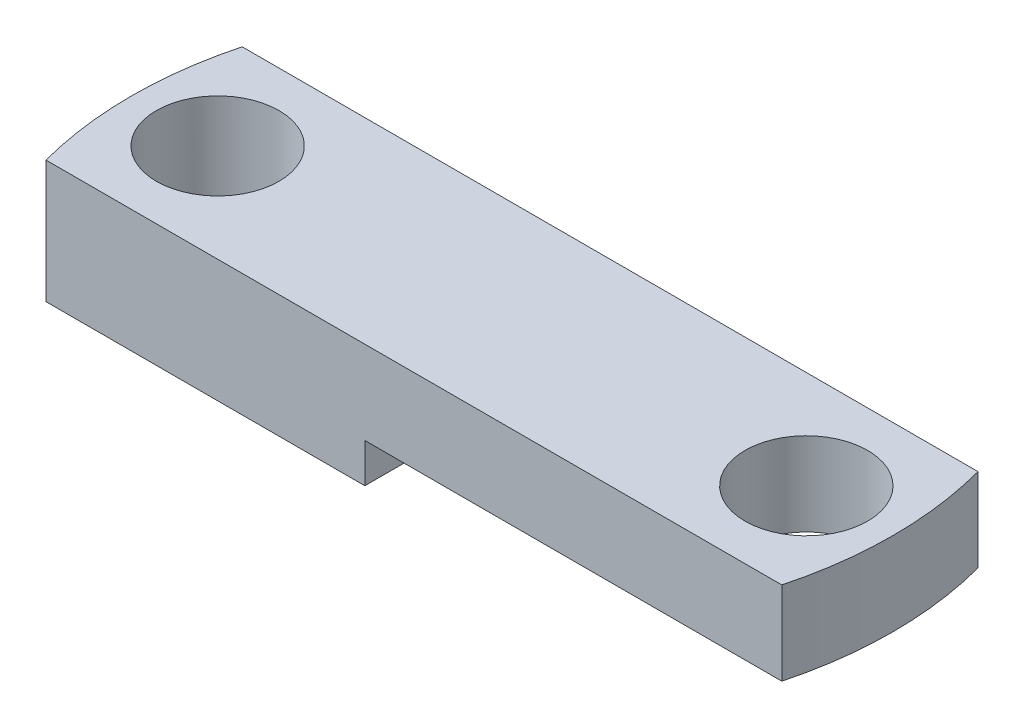
ISO-10303-21;
HEADER;
FILE_DESCRIPTION(('STEP AP214'),'2;1');
FILE_NAME('part.step','',(''),(''),'','','');
FILE_SCHEMA(('AUTOMOTIVE_DESIGN { 1 0 10303 214 1 1 1 1 }'));
ENDSEC;
DATA;
#1=APPLICATION_CONTEXT('core data for automotive mechanical design processes');
#2=APPLICATION_PROTOCOL_DEFINITION('international standard','automotive_design',2000,#1);
#3=PRODUCT_CONTEXT('',#1,'mechanical');
#4=PRODUCT('Part','Part','',(#3));
#5=PRODUCT_RELATED_PRODUCT_CATEGORY('part','',(#4));
#6=PRODUCT_DEFINITION_FORMATION('','',#4);
#7=PRODUCT_DEFINITION_CONTEXT('part definition',#1,'design');
#8=PRODUCT_DEFINITION('design','',#6,#7);
#9=PRODUCT_DEFINITION_SHAPE('','',#8);
#10=(LENGTH_UNIT() NAMED_UNIT(*) SI_UNIT(.MILLI.,.METRE.));
#11=(NAMED_UNIT(*) PLANE_ANGLE_UNIT() SI_UNIT($,.RADIAN.));
#12=(NAMED_UNIT(*) SI_UNIT($,.STERADIAN.) SOLID_ANGLE_UNIT());
#13=UNCERTAINTY_MEASURE_WITH_UNIT(LENGTH_MEASURE(1.E-05),#10,'distance_accuracy_value','');
#14=(GEOMETRIC_REPRESENTATION_CONTEXT(3) GLOBAL_UNCERTAINTY_ASSIGNED_CONTEXT((#13)) GLOBAL_UNIT_ASSIGNED_CONTEXT((#10,
#11,#12)) REPRESENTATION_CONTEXT('',''));
#15=CARTESIAN_POINT('',(0.,0.,0.));
#16=DIRECTION('',(0.,0.,1.));
#17=DIRECTION('',(1.,0.,0.));
#18=AXIS2_PLACEMENT_3D('',#15,#16,#17);
#19=CARTESIAN_POINT('',(0.,6.35,0.));
#20=DIRECTION('',(0.,-1.,0.));
#21=DIRECTION('',(0.,0.,-1.));
#22=AXIS2_PLACEMENT_3D('',#19,#20,#21);
#23=CYLINDRICAL_SURFACE('',#22,19.7157018642502);
#24=DIRECTION('',(0.,-1.,0.));
#25=VECTOR('',#24,1.);
#26=CARTESIAN_POINT('',(19.05,6.35,5.08));
#27=LINE('',#26,#25);
#28=CARTESIAN_POINT('',(19.05,6.35,5.08));
#29=VERTEX_POINT('',#28);
#30=CARTESIAN_POINT('',(19.05,2.032,5.08));
#31=VERTEX_POINT('',#30);
#32=EDGE_CURVE('E123',#29,#31,#27,.T.);
#33=ORIENTED_EDGE('',*,*,#32,.T.);
#34=CARTESIAN_POINT('',(0.,2.032,0.));
#35=DIRECTION('',(0.,-1.,0.));
#36=DIRECTION('',(0.,0.,1.));
#37=AXIS2_PLACEMENT_3D('',#34,#35,#36);
#38=CIRCLE('',#37,19.7157018642502);
#39=CARTESIAN_POINT('',(19.05,2.032,-5.08));
#40=VERTEX_POINT('',#39);
#41=EDGE_CURVE('E107',#40,#31,#38,.T.);
#42=ORIENTED_EDGE('',*,*,#41,.F.);
#43=DIRECTION('',(0.,-1.,0.));
#44=VECTOR('',#43,1.);
#45=CARTESIAN_POINT('',(19.05,6.35,-5.08));
#46=LINE('',#45,#44);
#47=CARTESIAN_POINT('',(19.05,6.35,-5.08));
#48=VERTEX_POINT('',#47);
#49=EDGE_CURVE('E11',#48,#40,#46,.T.);
#50=ORIENTED_EDGE('',*,*,#49,.F.);
#51=CARTESIAN_POINT('',(0.,6.35,0.));
#52=DIRECTION('',(0.,1.,0.));
#53=DIRECTION('',(0.,0.,1.));
#54=AXIS2_PLACEMENT_3D('',#51,#52,#53);
#55=CIRCLE('',#54,19.7157018642502);
#56=EDGE_CURVE('E127',#29,#48,#55,.T.);
#57=ORIENTED_EDGE('',*,*,#56,.F.);
#58=EDGE_LOOP('',(#33,#42,#50,#57));
#59=FACE_BOUND('',#58,.T.);
#60=ADVANCED_FACE('F43',(#59),#23,.T.);
#61=CARTESIAN_POINT('',(-19.05,6.35,-5.08));
#62=DIRECTION('',(0.,0.,1.));
#63=DIRECTION('',(1.,0.,0.));
#64=AXIS2_PLACEMENT_3D('',#61,#62,#63);
#65=PLANE('',#64);
#66=DIRECTION('',(1.,0.,0.));
#67=VECTOR('',#66,1.);
#68=CARTESIAN_POINT('',(19.05,2.032,-5.08));
#69=LINE('',#68,#67);
#70=CARTESIAN_POINT('',(-2.53999999999999,2.032,-5.08));
#71=VERTEX_POINT('',#70);
#72=EDGE_CURVE('E114',#71,#40,#69,.T.);
#73=ORIENTED_EDGE('',*,*,#72,.F.);
#74=DIRECTION('',(0.,-1.,0.));
#75=VECTOR('',#74,1.);
#76=CARTESIAN_POINT('',(-2.53999999999999,2.032,-5.08));
#77=LINE('',#76,#75);
#78=CARTESIAN_POINT('',(-2.53999999999999,0.,-5.08));
#79=VERTEX_POINT('',#78);
#80=EDGE_CURVE('E164',#71,#79,#77,.T.);
#81=ORIENTED_EDGE('',*,*,#80,.T.);
#82=DIRECTION('',(-1.,0.,0.));
#83=VECTOR('',#82,1.);
#84=CARTESIAN_POINT('',(-19.05,0.,-5.08));
#85=LINE('',#84,#83);
#86=CARTESIAN_POINT('',(-19.05,0.,-5.08));
#87=VERTEX_POINT('',#86);
#88=EDGE_CURVE('E139',#79,#87,#85,.T.);
#89=ORIENTED_EDGE('',*,*,#88,.T.);
#90=DIRECTION('',(0.,-1.,0.));
#91=VECTOR('',#90,1.);
#92=CARTESIAN_POINT('',(-19.05,6.35,-5.08));
#93=LINE('',#92,#91);
#94=CARTESIAN_POINT('',(-19.05,6.35,-5.08));
#95=VERTEX_POINT('',#94);
#96=EDGE_CURVE('E51',#95,#87,#93,.T.);
#97=ORIENTED_EDGE('',*,*,#96,.F.);
#98=DIRECTION('',(-1.,0.,0.));
#99=VECTOR('',#98,1.);
#100=CARTESIAN_POINT('',(-19.05,6.35,-5.08));
#101=LINE('',#100,#99);
#102=EDGE_CURVE('E91',#48,#95,#101,.T.);
#103=ORIENTED_EDGE('',*,*,#102,.F.);
#104=ORIENTED_EDGE('',*,*,#49,.T.);
#105=EDGE_LOOP('',(#73,#81,#89,#97,#103,#104));
#106=FACE_BOUND('',#105,.T.);
#107=ADVANCED_FACE('F166',(#106),#65,.F.);
#108=CARTESIAN_POINT('',(0.,6.35,0.));
#109=DIRECTION('',(0.,-1.,0.));
#110=DIRECTION('',(0.,0.,-1.));
#111=AXIS2_PLACEMENT_3D('',#108,#109,#110);
#112=CYLINDRICAL_SURFACE('',#111,19.7157018642502);
#113=CARTESIAN_POINT('',(0.,0.,0.));
#114=DIRECTION('',(0.,1.,0.));
#115=DIRECTION('',(0.,0.,1.));
#116=AXIS2_PLACEMENT_3D('',#113,#114,#115);
#117=CIRCLE('',#116,19.7157018642502);
#118=CARTESIAN_POINT('',(-19.05,0.,5.08));
#119=VERTEX_POINT('',#118);
#120=EDGE_CURVE('E84',#87,#119,#117,.T.);
#121=ORIENTED_EDGE('',*,*,#120,.T.);
#122=DIRECTION('',(0.,-1.,0.));
#123=VECTOR('',#122,1.);
#124=CARTESIAN_POINT('',(-19.05,6.35,5.08));
#125=LINE('',#124,#123);
#126=CARTESIAN_POINT('',(-19.05,6.35,5.08));
#127=VERTEX_POINT('',#126);
#128=EDGE_CURVE('E128',#127,#119,#125,.T.);
#129=ORIENTED_EDGE('',*,*,#128,.F.);
#130=CARTESIAN_POINT('',(0.,6.35,0.));
#131=DIRECTION('',(0.,1.,0.));
#132=DIRECTION('',(0.,0.,1.));
#133=AXIS2_PLACEMENT_3D('',#130,#131,#132);
#134=CIRCLE('',#133,19.7157018642502);
#135=EDGE_CURVE('E131',#95,#127,#134,.T.);
#136=ORIENTED_EDGE('',*,*,#135,.F.);
#137=ORIENTED_EDGE('',*,*,#96,.T.);
#138=EDGE_LOOP('',(#121,#129,#136,#137));
#139=FACE_BOUND('',#138,.T.);
#140=ADVANCED_FACE('F168',(#139),#112,.T.);
#141=CARTESIAN_POINT('',(-19.05,6.35,5.08));
#142=DIRECTION('',(0.,0.,-1.));
#143=DIRECTION('',(-1.,0.,0.));
#144=AXIS2_PLACEMENT_3D('',#141,#142,#143);
#145=PLANE('',#144);
#146=DIRECTION('',(1.,0.,0.));
#147=VECTOR('',#146,1.);
#148=CARTESIAN_POINT('',(-19.05,0.,5.08));
#149=LINE('',#148,#147);
#150=CARTESIAN_POINT('',(-2.53999999999999,0.,5.08));
#151=VERTEX_POINT('',#150);
#152=EDGE_CURVE('E134',#119,#151,#149,.T.);
#153=ORIENTED_EDGE('',*,*,#152,.T.);
#154=DIRECTION('',(0.,-1.,0.));
#155=VECTOR('',#154,1.);
#156=CARTESIAN_POINT('',(-2.53999999999999,2.032,5.08));
#157=LINE('',#156,#155);
#158=CARTESIAN_POINT('',(-2.53999999999999,2.032,5.08));
#159=VERTEX_POINT('',#158);
#160=EDGE_CURVE('E59',#159,#151,#157,.T.);
#161=ORIENTED_EDGE('',*,*,#160,.F.);
#162=DIRECTION('',(-1.,0.,0.));
#163=VECTOR('',#162,1.);
#164=CARTESIAN_POINT('',(19.05,2.032,5.08));
#165=LINE('',#164,#163);
#166=EDGE_CURVE('E112',#31,#159,#165,.T.);
#167=ORIENTED_EDGE('',*,*,#166,.F.);
#168=ORIENTED_EDGE('',*,*,#32,.F.);
#169=DIRECTION('',(1.,0.,0.));
#170=VECTOR('',#169,1.);
#171=CARTESIAN_POINT('',(-19.05,6.35,5.08));
#172=LINE('',#171,#170);
#173=EDGE_CURVE('E68',#127,#29,#172,.T.);
#174=ORIENTED_EDGE('',*,*,#173,.F.);
#175=ORIENTED_EDGE('',*,*,#128,.T.);
#176=EDGE_LOOP('',(#153,#161,#167,#168,#174,#175));
#177=FACE_BOUND('',#176,.T.);
#178=ADVANCED_FACE('F122',(#177),#145,.F.);
#179=CARTESIAN_POINT('',(0.,6.35,0.));
#180=DIRECTION('',(0.,1.,0.));
#181=DIRECTION('',(0.,0.,1.));
#182=AXIS2_PLACEMENT_3D('',#179,#180,#181);
#183=PLANE('',#182);
#184=CARTESIAN_POINT('',(-15.24,6.35,0.));
#185=DIRECTION('',(0.,1.,0.));
#186=DIRECTION('',(0.,0.,-1.));
#187=AXIS2_PLACEMENT_3D('',#184,#185,#186);
#188=CIRCLE('',#187,3.175);
#189=CARTESIAN_POINT('',(-15.24,6.35,-3.175));
#190=VERTEX_POINT('',#189);
#191=EDGE_CURVE('E140',#190,#190,#188,.T.);
#192=ORIENTED_EDGE('',*,*,#191,.F.);
#193=EDGE_LOOP('',(#192));
#194=FACE_BOUND('',#193,.T.);
#195=CARTESIAN_POINT('',(15.24,6.35,0.));
#196=DIRECTION('',(0.,1.,0.));
#197=DIRECTION('',(0.,0.,1.));
#198=AXIS2_PLACEMENT_3D('',#195,#196,#197);
#199=CIRCLE('',#198,3.17500000000001);
#200=CARTESIAN_POINT('',(15.24,6.35,3.17500000000001));
#201=VERTEX_POINT('',#200);
#202=EDGE_CURVE('E145',#201,#201,#199,.T.);
#203=ORIENTED_EDGE('',*,*,#202,.F.);
#204=EDGE_LOOP('',(#203));
#205=FACE_BOUND('',#204,.T.);
#206=ORIENTED_EDGE('',*,*,#56,.T.);
#207=ORIENTED_EDGE('',*,*,#102,.T.);
#208=ORIENTED_EDGE('',*,*,#135,.T.);
#209=ORIENTED_EDGE('',*,*,#173,.T.);
#210=EDGE_LOOP('',(#206,#207,#208,#209));
#211=FACE_BOUND('',#210,.T.);
#212=ADVANCED_FACE('F177',(#194,#205,#211),#183,.T.);
#213=CARTESIAN_POINT('',(0.,0.,0.));
#214=DIRECTION('',(0.,1.,0.));
#215=DIRECTION('',(0.,0.,1.));
#216=AXIS2_PLACEMENT_3D('',#213,#214,#215);
#217=PLANE('',#216);
#218=CARTESIAN_POINT('',(-15.24,0.,0.));
#219=DIRECTION('',(0.,1.,0.));
#220=DIRECTION('',(0.,0.,1.));
#221=AXIS2_PLACEMENT_3D('',#218,#219,#220);
#222=CIRCLE('',#221,3.175);
#223=CARTESIAN_POINT('',(-15.24,0.,3.17500000000001));
#224=VERTEX_POINT('',#223);
#225=EDGE_CURVE('E137',#224,#224,#222,.T.);
#226=ORIENTED_EDGE('',*,*,#225,.T.);
#227=EDGE_LOOP('',(#226));
#228=FACE_BOUND('',#227,.T.);
#229=ORIENTED_EDGE('',*,*,#88,.F.);
#230=DIRECTION('',(0.,0.,-1.));
#231=VECTOR('',#230,1.);
#232=CARTESIAN_POINT('',(-2.53999999999999,0.,5.08));
#233=LINE('',#232,#231);
#234=EDGE_CURVE('E118',#151,#79,#233,.T.);
#235=ORIENTED_EDGE('',*,*,#234,.F.);
#236=ORIENTED_EDGE('',*,*,#152,.F.);
#237=ORIENTED_EDGE('',*,*,#120,.F.);
#238=EDGE_LOOP('',(#229,#235,#236,#237));
#239=FACE_BOUND('',#238,.T.);
#240=ADVANCED_FACE('F159',(#228,#239),#217,.F.);
#241=CARTESIAN_POINT('',(15.24,-6.35,0.));
#242=DIRECTION('',(0.,1.,0.));
#243=DIRECTION('',(0.,0.,1.));
#244=AXIS2_PLACEMENT_3D('',#241,#242,#243);
#245=CYLINDRICAL_SURFACE('',#244,3.17500000000001);
#246=CARTESIAN_POINT('',(15.24,2.032,0.));
#247=DIRECTION('',(0.,1.,0.));
#248=DIRECTION('',(0.,0.,1.));
#249=AXIS2_PLACEMENT_3D('',#246,#247,#248);
#250=CIRCLE('',#249,3.17500000000001);
#251=CARTESIAN_POINT('',(15.24,2.032,3.17500000000001));
#252=VERTEX_POINT('',#251);
#253=EDGE_CURVE('E46',#252,#252,#250,.F.);
#254=ORIENTED_EDGE('',*,*,#253,.T.);
#255=EDGE_LOOP('',(#254));
#256=FACE_BOUND('',#255,.T.);
#257=ORIENTED_EDGE('',*,*,#202,.T.);
#258=EDGE_LOOP('',(#257));
#259=FACE_BOUND('',#258,.T.);
#260=ADVANCED_FACE('F180',(#256,#259),#245,.F.);
#261=CARTESIAN_POINT('',(-15.24,-6.35,0.));
#262=DIRECTION('',(0.,1.,0.));
#263=DIRECTION('',(0.,0.,1.));
#264=AXIS2_PLACEMENT_3D('',#261,#262,#263);
#265=CYLINDRICAL_SURFACE('',#264,3.175);
#266=ORIENTED_EDGE('',*,*,#191,.T.);
#267=EDGE_LOOP('',(#266));
#268=FACE_BOUND('',#267,.T.);
#269=ORIENTED_EDGE('',*,*,#225,.F.);
#270=EDGE_LOOP('',(#269));
#271=FACE_BOUND('',#270,.T.);
#272=ADVANCED_FACE('F186',(#268,#271),#265,.F.);
#273=CARTESIAN_POINT('',(0.,2.032,0.));
#274=DIRECTION('',(0.,1.,0.));
#275=DIRECTION('',(0.,0.,1.));
#276=AXIS2_PLACEMENT_3D('',#273,#274,#275);
#277=PLANE('',#276);
#278=ORIENTED_EDGE('',*,*,#41,.T.);
#279=ORIENTED_EDGE('',*,*,#166,.T.);
#280=DIRECTION('',(0.,0.,-1.));
#281=VECTOR('',#280,1.);
#282=CARTESIAN_POINT('',(-2.53999999999999,2.032,5.08));
#283=LINE('',#282,#281);
#284=EDGE_CURVE('E125',#159,#71,#283,.T.);
#285=ORIENTED_EDGE('',*,*,#284,.T.);
#286=ORIENTED_EDGE('',*,*,#72,.T.);
#287=EDGE_LOOP('',(#278,#279,#285,#286));
#288=FACE_BOUND('',#287,.T.);
#289=ORIENTED_EDGE('',*,*,#253,.F.);
#290=EDGE_LOOP('',(#289));
#291=FACE_BOUND('',#290,.T.);
#292=ADVANCED_FACE('F109',(#288,#291),#277,.F.);
#293=CARTESIAN_POINT('',(-2.53999999999999,2.032,5.08));
#294=DIRECTION('',(-1.,0.,0.));
#295=DIRECTION('',(0.,0.,1.));
#296=AXIS2_PLACEMENT_3D('',#293,#294,#295);
#297=PLANE('',#296);
#298=ORIENTED_EDGE('',*,*,#234,.T.);
#299=ORIENTED_EDGE('',*,*,#80,.F.);
#300=ORIENTED_EDGE('',*,*,#284,.F.);
#301=ORIENTED_EDGE('',*,*,#160,.T.);
#302=EDGE_LOOP('',(#298,#299,#300,#301));
#303=FACE_BOUND('',#302,.T.);
#304=ADVANCED_FACE('F190',(#303),#297,.F.);
#305=CLOSED_SHELL('',(#60,#107,#140,#178,#212,#240,#260,#272,#292,#304));
#306=MANIFOLD_SOLID_BREP('B2',#305);
#307=ADVANCED_BREP_SHAPE_REPRESENTATION('',(#18,#306),#14);
#308=SHAPE_DEFINITION_REPRESENTATION(#9,#307);
ENDSEC;
END-ISO-10303-21;
